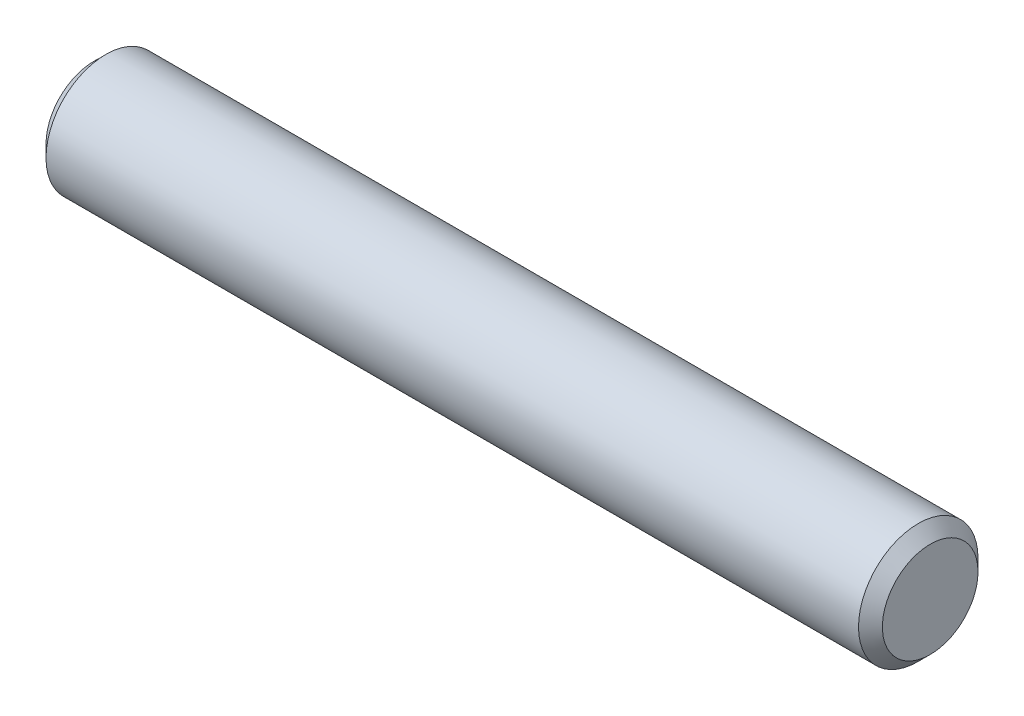
ISO-10303-21;
HEADER;
FILE_DESCRIPTION(('STEP AP214'),'2;1');
FILE_NAME('part.step','',(''),(''),'','','');
FILE_SCHEMA(('AUTOMOTIVE_DESIGN { 1 0 10303 214 1 1 1 1 }'));
ENDSEC;
DATA;
#1=APPLICATION_CONTEXT('core data for automotive mechanical design processes');
#2=APPLICATION_PROTOCOL_DEFINITION('international standard','automotive_design',2000,#1);
#3=PRODUCT_CONTEXT('',#1,'mechanical');
#4=PRODUCT('Part','Part','',(#3));
#5=PRODUCT_RELATED_PRODUCT_CATEGORY('part','',(#4));
#6=PRODUCT_DEFINITION_FORMATION('','',#4);
#7=PRODUCT_DEFINITION_CONTEXT('part definition',#1,'design');
#8=PRODUCT_DEFINITION('design','',#6,#7);
#9=PRODUCT_DEFINITION_SHAPE('','',#8);
#10=(LENGTH_UNIT() NAMED_UNIT(*) SI_UNIT(.MILLI.,.METRE.));
#11=(NAMED_UNIT(*) PLANE_ANGLE_UNIT() SI_UNIT($,.RADIAN.));
#12=(NAMED_UNIT(*) SI_UNIT($,.STERADIAN.) SOLID_ANGLE_UNIT());
#13=UNCERTAINTY_MEASURE_WITH_UNIT(LENGTH_MEASURE(1.E-05),#10,'distance_accuracy_value','');
#14=(GEOMETRIC_REPRESENTATION_CONTEXT(3) GLOBAL_UNCERTAINTY_ASSIGNED_CONTEXT((#13)) GLOBAL_UNIT_ASSIGNED_CONTEXT((#10,
#11,#12)) REPRESENTATION_CONTEXT('',''));
#15=CARTESIAN_POINT('',(0.,0.,0.));
#16=DIRECTION('',(0.,0.,1.));
#17=DIRECTION('',(1.,0.,0.));
#18=AXIS2_PLACEMENT_3D('',#15,#16,#17);
#19=CARTESIAN_POINT('',(22.225,0.,0.));
#20=DIRECTION('',(1.,0.,0.));
#21=DIRECTION('',(0.,1.,0.));
#22=AXIS2_PLACEMENT_3D('',#19,#20,#21);
#23=PLANE('',#22);
#24=CARTESIAN_POINT('',(22.225,0.,0.));
#25=DIRECTION('',(1.,0.,0.));
#26=DIRECTION('',(0.,0.,-1.));
#27=AXIS2_PLACEMENT_3D('',#24,#25,#26);
#28=CIRCLE('',#27,2.54);
#29=CARTESIAN_POINT('',(22.225,0.,-2.54));
#30=VERTEX_POINT('',#29);
#31=EDGE_CURVE('E21',#30,#30,#28,.T.);
#32=ORIENTED_EDGE('',*,*,#31,.T.);
#33=EDGE_LOOP('',(#32));
#34=FACE_BOUND('',#33,.T.);
#35=ADVANCED_FACE('F17',(#34),#23,.T.);
#36=CARTESIAN_POINT('',(-22.225,0.,0.));
#37=DIRECTION('',(1.,0.,0.));
#38=DIRECTION('',(0.,1.,0.));
#39=AXIS2_PLACEMENT_3D('',#36,#37,#38);
#40=PLANE('',#39);
#41=CARTESIAN_POINT('',(-22.225,0.,0.));
#42=DIRECTION('',(-1.,0.,0.));
#43=DIRECTION('',(0.,0.,-1.));
#44=AXIS2_PLACEMENT_3D('',#41,#42,#43);
#45=CIRCLE('',#44,2.54);
#46=CARTESIAN_POINT('',(-22.225,0.,2.54));
#47=VERTEX_POINT('',#46);
#48=EDGE_CURVE('E70',#47,#47,#45,.T.);
#49=ORIENTED_EDGE('',*,*,#48,.T.);
#50=EDGE_LOOP('',(#49));
#51=FACE_BOUND('',#50,.T.);
#52=ADVANCED_FACE('F19',(#51),#40,.F.);
#53=CARTESIAN_POINT('',(-22.225,0.,0.));
#54=DIRECTION('',(1.,0.,0.));
#55=DIRECTION('',(0.,0.,-1.));
#56=AXIS2_PLACEMENT_3D('',#53,#54,#55);
#57=CYLINDRICAL_SURFACE('',#56,3.175);
#58=CARTESIAN_POINT('',(21.59,0.,0.));
#59=DIRECTION('',(-1.,0.,0.));
#60=DIRECTION('',(0.,0.,-1.));
#61=AXIS2_PLACEMENT_3D('',#58,#59,#60);
#62=CIRCLE('',#61,3.175);
#63=CARTESIAN_POINT('',(21.59,0.,3.175));
#64=VERTEX_POINT('',#63);
#65=CARTESIAN_POINT('',(21.59,0.,-3.175));
#66=VERTEX_POINT('',#65);
#67=EDGE_CURVE('E76',#64,#66,#62,.T.);
#68=ORIENTED_EDGE('',*,*,#67,.T.);
#69=CARTESIAN_POINT('',(21.59,0.,0.));
#70=DIRECTION('',(-1.,0.,0.));
#71=DIRECTION('',(0.,0.,-1.));
#72=AXIS2_PLACEMENT_3D('',#69,#70,#71);
#73=CIRCLE('',#72,3.175);
#74=EDGE_CURVE('E64',#66,#64,#73,.T.);
#75=ORIENTED_EDGE('',*,*,#74,.T.);
#76=DIRECTION('',(-1.,0.,0.));
#77=VECTOR('',#76,1.);
#78=CARTESIAN_POINT('',(-22.225,0.,3.175));
#79=LINE('',#78,#77);
#80=CARTESIAN_POINT('',(-21.59,0.,3.175));
#81=VERTEX_POINT('',#80);
#82=EDGE_CURVE('E11',#64,#81,#79,.T.);
#83=ORIENTED_EDGE('',*,*,#82,.T.);
#84=CARTESIAN_POINT('',(-21.59,0.,0.));
#85=DIRECTION('',(1.,0.,0.));
#86=DIRECTION('',(0.,0.,-1.));
#87=AXIS2_PLACEMENT_3D('',#84,#85,#86);
#88=CIRCLE('',#87,3.175);
#89=EDGE_CURVE('E63',#81,#81,#88,.T.);
#90=ORIENTED_EDGE('',*,*,#89,.T.);
#91=ORIENTED_EDGE('',*,*,#82,.F.);
#92=EDGE_LOOP('',(#68,#75,#83,#90,#91));
#93=FACE_BOUND('',#92,.T.);
#94=ADVANCED_FACE('F61',(#93),#57,.T.);
#95=CARTESIAN_POINT('',(22.225,0.,0.));
#96=DIRECTION('',(-1.,0.,0.));
#97=DIRECTION('',(0.,0.,1.));
#98=AXIS2_PLACEMENT_3D('',#95,#96,#97);
#99=CONICAL_SURFACE('',#98,2.54,0.785398163397445);
#100=ORIENTED_EDGE('',*,*,#67,.F.);
#101=ORIENTED_EDGE('',*,*,#74,.F.);
#102=DIRECTION('',(0.70710678118655,0.,0.707106781186545));
#103=VECTOR('',#102,1.);
#104=CARTESIAN_POINT('',(22.225,0.,-2.54));
#105=LINE('',#104,#103);
#106=EDGE_CURVE('E44',#66,#30,#105,.T.);
#107=ORIENTED_EDGE('',*,*,#106,.T.);
#108=ORIENTED_EDGE('',*,*,#31,.F.);
#109=ORIENTED_EDGE('',*,*,#106,.F.);
#110=EDGE_LOOP('',(#100,#101,#107,#108,#109));
#111=FACE_BOUND('',#110,.T.);
#112=ADVANCED_FACE('F94',(#111),#99,.T.);
#113=CARTESIAN_POINT('',(-21.59,0.,0.));
#114=DIRECTION('',(1.,0.,0.));
#115=DIRECTION('',(0.,0.,-1.));
#116=AXIS2_PLACEMENT_3D('',#113,#114,#115);
#117=CONICAL_SURFACE('',#116,3.175,0.78539816339745);
#118=ORIENTED_EDGE('',*,*,#89,.F.);
#119=DIRECTION('',(-0.707106781186546,0.,-0.707106781186549));
#120=VECTOR('',#119,1.);
#121=CARTESIAN_POINT('',(-21.59,0.,3.175));
#122=LINE('',#121,#120);
#123=EDGE_CURVE('E68',#81,#47,#122,.T.);
#124=ORIENTED_EDGE('',*,*,#123,.T.);
#125=ORIENTED_EDGE('',*,*,#48,.F.);
#126=ORIENTED_EDGE('',*,*,#123,.F.);
#127=EDGE_LOOP('',(#118,#124,#125,#126));
#128=FACE_BOUND('',#127,.T.);
#129=ADVANCED_FACE('F69',(#128),#117,.T.);
#130=CLOSED_SHELL('',(#35,#52,#94,#112,#129));
#131=MANIFOLD_SOLID_BREP('B1',#130);
#132=ADVANCED_BREP_SHAPE_REPRESENTATION('',(#18,#131),#14);
#133=SHAPE_DEFINITION_REPRESENTATION(#9,#132);
ENDSEC;
END-ISO-10303-21;
